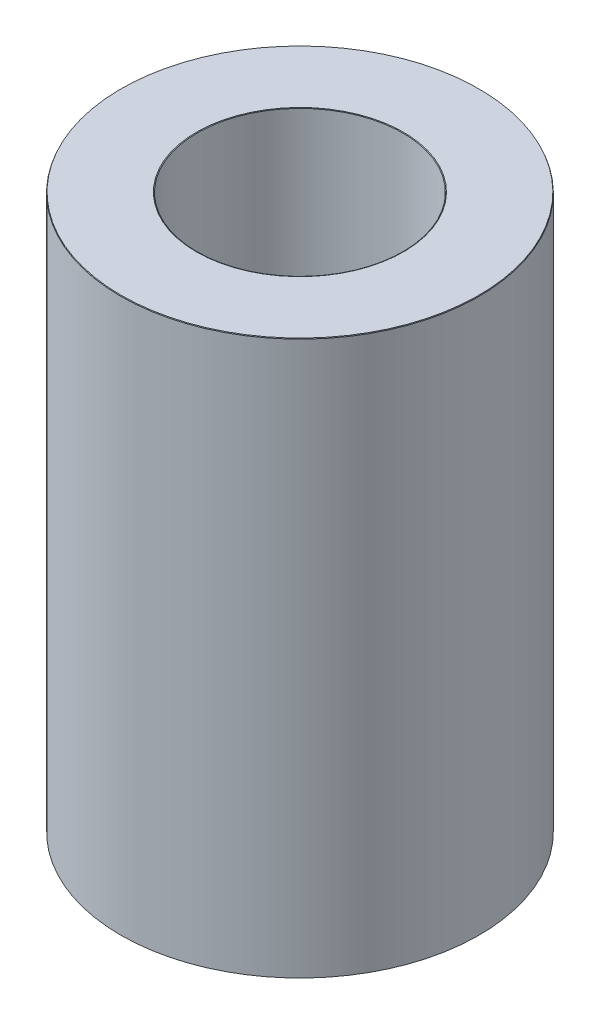
ISO-10303-21;
HEADER;
FILE_DESCRIPTION(('STEP AP214'),'2;1');
FILE_NAME('part.step','',(''),(''),'','','');
FILE_SCHEMA(('AUTOMOTIVE_DESIGN { 1 0 10303 214 1 1 1 1 }'));
ENDSEC;
DATA;
#1=APPLICATION_CONTEXT('core data for automotive mechanical design processes');
#2=APPLICATION_PROTOCOL_DEFINITION('international standard','automotive_design',2000,#1);
#3=PRODUCT_CONTEXT('',#1,'mechanical');
#4=PRODUCT('Part','Part','',(#3));
#5=PRODUCT_RELATED_PRODUCT_CATEGORY('part','',(#4));
#6=PRODUCT_DEFINITION_FORMATION('','',#4);
#7=PRODUCT_DEFINITION_CONTEXT('part definition',#1,'design');
#8=PRODUCT_DEFINITION('design','',#6,#7);
#9=PRODUCT_DEFINITION_SHAPE('','',#8);
#10=(LENGTH_UNIT() NAMED_UNIT(*) SI_UNIT(.MILLI.,.METRE.));
#11=(NAMED_UNIT(*) PLANE_ANGLE_UNIT() SI_UNIT($,.RADIAN.));
#12=(NAMED_UNIT(*) SI_UNIT($,.STERADIAN.) SOLID_ANGLE_UNIT());
#13=UNCERTAINTY_MEASURE_WITH_UNIT(LENGTH_MEASURE(1.E-05),#10,'distance_accuracy_value','');
#14=(GEOMETRIC_REPRESENTATION_CONTEXT(3) GLOBAL_UNCERTAINTY_ASSIGNED_CONTEXT((#13)) GLOBAL_UNIT_ASSIGNED_CONTEXT((#10,
#11,#12)) REPRESENTATION_CONTEXT('',''));
#15=CARTESIAN_POINT('',(0.,0.,0.));
#16=DIRECTION('',(0.,0.,1.));
#17=DIRECTION('',(1.,0.,0.));
#18=AXIS2_PLACEMENT_3D('',#15,#16,#17);
#19=CARTESIAN_POINT('',(0.,170.162111079568,0.));
#20=DIRECTION('',(0.,-1.,0.));
#21=DIRECTION('',(0.,0.,-1.));
#22=AXIS2_PLACEMENT_3D('',#19,#20,#21);
#23=CYLINDRICAL_SURFACE('',#22,55.);
#24=CARTESIAN_POINT('',(0.,0.0981847820674397,0.));
#25=DIRECTION('',(0.,1.,0.));
#26=DIRECTION('',(0.,0.,1.));
#27=AXIS2_PLACEMENT_3D('',#24,#25,#26);
#28=CIRCLE('',#27,55.);
#29=CARTESIAN_POINT('',(0.,0.0981847820674397,55.));
#30=VERTEX_POINT('',#29);
#31=EDGE_CURVE('E10',#30,#30,#28,.T.);
#32=ORIENTED_EDGE('',*,*,#31,.T.);
#33=EDGE_LOOP('',(#32));
#34=FACE_BOUND('',#33,.T.);
#35=CARTESIAN_POINT('',(0.,169.934284420035,0.));
#36=DIRECTION('',(0.,1.,0.));
#37=DIRECTION('',(0.,0.,1.));
#38=AXIS2_PLACEMENT_3D('',#35,#36,#37);
#39=CIRCLE('',#38,55.);
#40=CARTESIAN_POINT('',(0.,169.934284420035,55.));
#41=VERTEX_POINT('',#40);
#42=EDGE_CURVE('E50',#41,#41,#39,.F.);
#43=ORIENTED_EDGE('',*,*,#42,.T.);
#44=EDGE_LOOP('',(#43));
#45=FACE_BOUND('',#44,.T.);
#46=ADVANCED_FACE('F39',(#34,#45),#23,.T.);
#47=CARTESIAN_POINT('',(0.,170.162111079568,0.));
#48=DIRECTION('',(0.,1.,0.));
#49=DIRECTION('',(0.,0.,1.));
#50=AXIS2_PLACEMENT_3D('',#47,#48,#49);
#51=PLANE('',#50);
#52=CARTESIAN_POINT('',(0.,170.162111079568,0.));
#53=DIRECTION('',(0.,1.,0.));
#54=DIRECTION('',(0.,0.,1.));
#55=AXIS2_PLACEMENT_3D('',#52,#53,#54);
#56=CIRCLE('',#55,31.8081265672599);
#57=CARTESIAN_POINT('',(0.,170.162111079568,31.8081265672599));
#58=VERTEX_POINT('',#57);
#59=EDGE_CURVE('E58',#58,#58,#56,.F.);
#60=ORIENTED_EDGE('',*,*,#59,.T.);
#61=EDGE_LOOP('',(#60));
#62=FACE_BOUND('',#61,.T.);
#63=CARTESIAN_POINT('',(0.,170.162111079568,0.));
#64=DIRECTION('',(0.,1.,0.));
#65=DIRECTION('',(0.,0.,1.));
#66=AXIS2_PLACEMENT_3D('',#63,#64,#65);
#67=CIRCLE('',#66,54.9018152179325);
#68=CARTESIAN_POINT('',(0.,170.162111079568,54.9018152179325));
#69=VERTEX_POINT('',#68);
#70=EDGE_CURVE('E61',#69,#69,#67,.T.);
#71=ORIENTED_EDGE('',*,*,#70,.T.);
#72=EDGE_LOOP('',(#71));
#73=FACE_BOUND('',#72,.T.);
#74=ADVANCED_FACE('F88',(#62,#73),#51,.T.);
#75=CARTESIAN_POINT('',(0.,0.,0.));
#76=DIRECTION('',(0.,1.,0.));
#77=DIRECTION('',(0.,0.,1.));
#78=AXIS2_PLACEMENT_3D('',#75,#76,#77);
#79=PLANE('',#78);
#80=CARTESIAN_POINT('',(0.,0.,0.));
#81=DIRECTION('',(0.,1.,0.));
#82=DIRECTION('',(0.,0.,1.));
#83=AXIS2_PLACEMENT_3D('',#80,#81,#82);
#84=CIRCLE('',#83,31.6784846897937);
#85=CARTESIAN_POINT('',(0.,0.,31.6784846897937));
#86=VERTEX_POINT('',#85);
#87=EDGE_CURVE('E51',#86,#86,#84,.T.);
#88=ORIENTED_EDGE('',*,*,#87,.T.);
#89=EDGE_LOOP('',(#88));
#90=FACE_BOUND('',#89,.T.);
#91=CARTESIAN_POINT('',(0.,0.,0.));
#92=DIRECTION('',(0.,1.,0.));
#93=DIRECTION('',(0.,0.,1.));
#94=AXIS2_PLACEMENT_3D('',#91,#92,#93);
#95=CIRCLE('',#94,54.7721733404665);
#96=CARTESIAN_POINT('',(0.,0.,54.7721733404665));
#97=VERTEX_POINT('',#96);
#98=EDGE_CURVE('E54',#97,#97,#95,.F.);
#99=ORIENTED_EDGE('',*,*,#98,.T.);
#100=EDGE_LOOP('',(#99));
#101=FACE_BOUND('',#100,.T.);
#102=ADVANCED_FACE('F83',(#90,#101),#79,.F.);
#103=CARTESIAN_POINT('',(0.,170.162111079568,0.));
#104=DIRECTION('',(0.,-1.,0.));
#105=DIRECTION('',(0.,0.,-1.));
#106=AXIS2_PLACEMENT_3D('',#103,#104,#105);
#107=CYLINDRICAL_SURFACE('',#106,31.5802999077263);
#108=CARTESIAN_POINT('',(0.,170.063926297501,0.));
#109=DIRECTION('',(0.,1.,0.));
#110=DIRECTION('',(0.,0.,1.));
#111=AXIS2_PLACEMENT_3D('',#108,#109,#110);
#112=CIRCLE('',#111,31.5802999077263);
#113=CARTESIAN_POINT('',(0.,170.063926297501,31.5802999077263));
#114=VERTEX_POINT('',#113);
#115=EDGE_CURVE('E67',#114,#114,#112,.T.);
#116=ORIENTED_EDGE('',*,*,#115,.T.);
#117=EDGE_LOOP('',(#116));
#118=FACE_BOUND('',#117,.T.);
#119=CARTESIAN_POINT('',(0.,0.227826659533581,0.));
#120=DIRECTION('',(0.,1.,0.));
#121=DIRECTION('',(0.,0.,1.));
#122=AXIS2_PLACEMENT_3D('',#119,#120,#121);
#123=CIRCLE('',#122,31.5802999077263);
#124=CARTESIAN_POINT('',(0.,0.227826659533581,31.5802999077263));
#125=VERTEX_POINT('',#124);
#126=EDGE_CURVE('E69',#125,#125,#123,.F.);
#127=ORIENTED_EDGE('',*,*,#126,.T.);
#128=EDGE_LOOP('',(#127));
#129=FACE_BOUND('',#128,.T.);
#130=ADVANCED_FACE('F71',(#118,#129),#107,.F.);
#131=CARTESIAN_POINT('',(0.,170.063926297501,0.));
#132=DIRECTION('',(0.,1.,0.));
#133=DIRECTION('',(0.,0.,1.));
#134=AXIS2_PLACEMENT_3D('',#131,#132,#133);
#135=CONICAL_SURFACE('',#134,31.5802999077263,1.16388611674852);
#136=ORIENTED_EDGE('',*,*,#59,.F.);
#137=EDGE_LOOP('',(#136));
#138=FACE_BOUND('',#137,.T.);
#139=ORIENTED_EDGE('',*,*,#115,.F.);
#140=EDGE_LOOP('',(#139));
#141=FACE_BOUND('',#140,.T.);
#142=ADVANCED_FACE('F77',(#138,#141),#135,.F.);
#143=CARTESIAN_POINT('',(0.,0.,0.));
#144=DIRECTION('',(0.,-1.,0.));
#145=DIRECTION('',(0.,0.,-1.));
#146=AXIS2_PLACEMENT_3D('',#143,#144,#145);
#147=CONICAL_SURFACE('',#146,31.6784846897937,0.406910210046417);
#148=ORIENTED_EDGE('',*,*,#126,.F.);
#149=EDGE_LOOP('',(#148));
#150=FACE_BOUND('',#149,.T.);
#151=ORIENTED_EDGE('',*,*,#87,.F.);
#152=EDGE_LOOP('',(#151));
#153=FACE_BOUND('',#152,.T.);
#154=ADVANCED_FACE('F73',(#150,#153),#147,.F.);
#155=CARTESIAN_POINT('',(0.,0.0981847820674397,0.));
#156=DIRECTION('',(0.,1.,0.));
#157=DIRECTION('',(0.,0.,1.));
#158=AXIS2_PLACEMENT_3D('',#155,#156,#157);
#159=CONICAL_SURFACE('',#158,55.,1.16388611674851);
#160=ORIENTED_EDGE('',*,*,#98,.F.);
#161=EDGE_LOOP('',(#160));
#162=FACE_BOUND('',#161,.T.);
#163=ORIENTED_EDGE('',*,*,#31,.F.);
#164=EDGE_LOOP('',(#163));
#165=FACE_BOUND('',#164,.T.);
#166=ADVANCED_FACE('F76',(#162,#165),#159,.T.);
#167=CARTESIAN_POINT('',(0.,170.162111079568,0.));
#168=DIRECTION('',(0.,-1.,0.));
#169=DIRECTION('',(0.,0.,-1.));
#170=AXIS2_PLACEMENT_3D('',#167,#168,#169);
#171=CONICAL_SURFACE('',#170,54.9018152179325,0.406910210046387);
#172=ORIENTED_EDGE('',*,*,#42,.F.);
#173=EDGE_LOOP('',(#172));
#174=FACE_BOUND('',#173,.T.);
#175=ORIENTED_EDGE('',*,*,#70,.F.);
#176=EDGE_LOOP('',(#175));
#177=FACE_BOUND('',#176,.T.);
#178=ADVANCED_FACE('F45',(#174,#177),#171,.T.);
#179=CLOSED_SHELL('',(#46,#74,#102,#130,#142,#154,#166,#178));
#180=MANIFOLD_SOLID_BREP('B2',#179);
#181=ADVANCED_BREP_SHAPE_REPRESENTATION('',(#18,#180),#14);
#182=SHAPE_DEFINITION_REPRESENTATION(#9,#181);
ENDSEC;
END-ISO-10303-21;
